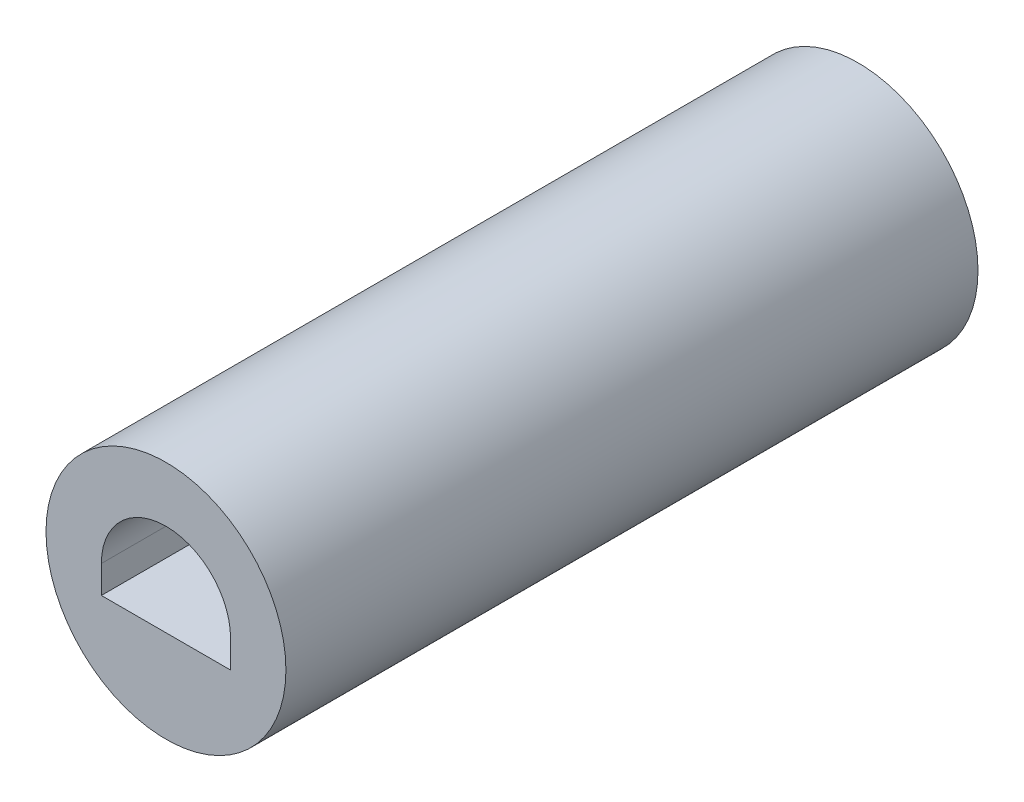
ISO-10303-21;
HEADER;
FILE_DESCRIPTION(('STEP AP214'),'2;1');
FILE_NAME('part.step','',(''),(''),'','','');
FILE_SCHEMA(('AUTOMOTIVE_DESIGN { 1 0 10303 214 1 1 1 1 }'));
ENDSEC;
DATA;
#1=APPLICATION_CONTEXT('core data for automotive mechanical design processes');
#2=APPLICATION_PROTOCOL_DEFINITION('international standard','automotive_design',2000,#1);
#3=PRODUCT_CONTEXT('',#1,'mechanical');
#4=PRODUCT('Part','Part','',(#3));
#5=PRODUCT_RELATED_PRODUCT_CATEGORY('part','',(#4));
#6=PRODUCT_DEFINITION_FORMATION('','',#4);
#7=PRODUCT_DEFINITION_CONTEXT('part definition',#1,'design');
#8=PRODUCT_DEFINITION('design','',#6,#7);
#9=PRODUCT_DEFINITION_SHAPE('','',#8);
#10=(LENGTH_UNIT() NAMED_UNIT(*) SI_UNIT(.MILLI.,.METRE.));
#11=(NAMED_UNIT(*) PLANE_ANGLE_UNIT() SI_UNIT($,.RADIAN.));
#12=(NAMED_UNIT(*) SI_UNIT($,.STERADIAN.) SOLID_ANGLE_UNIT());
#13=UNCERTAINTY_MEASURE_WITH_UNIT(LENGTH_MEASURE(1.E-05),#10,'distance_accuracy_value','');
#14=(GEOMETRIC_REPRESENTATION_CONTEXT(3) GLOBAL_UNCERTAINTY_ASSIGNED_CONTEXT((#13)) GLOBAL_UNIT_ASSIGNED_CONTEXT((#10,
#11,#12)) REPRESENTATION_CONTEXT('',''));
#15=CARTESIAN_POINT('',(0.,0.,0.));
#16=DIRECTION('',(0.,0.,1.));
#17=DIRECTION('',(1.,0.,0.));
#18=AXIS2_PLACEMENT_3D('',#15,#16,#17);
#19=CARTESIAN_POINT('',(0.,0.,9.525));
#20=DIRECTION('',(0.,0.,-1.));
#21=DIRECTION('',(-1.,0.,0.));
#22=AXIS2_PLACEMENT_3D('',#19,#20,#21);
#23=CYLINDRICAL_SURFACE('',#22,1.651);
#24=CARTESIAN_POINT('',(0.,0.,9.525));
#25=DIRECTION('',(0.,0.,1.));
#26=DIRECTION('',(1.,0.,0.));
#27=AXIS2_PLACEMENT_3D('',#24,#25,#26);
#28=CIRCLE('',#27,1.651);
#29=CARTESIAN_POINT('',(1.651,0.,9.525));
#30=VERTEX_POINT('',#29);
#31=EDGE_CURVE('E11',#30,#30,#28,.T.);
#32=ORIENTED_EDGE('',*,*,#31,.F.);
#33=EDGE_LOOP('',(#32));
#34=FACE_BOUND('',#33,.T.);
#35=CARTESIAN_POINT('',(0.,0.,0.));
#36=DIRECTION('',(0.,0.,1.));
#37=DIRECTION('',(1.,0.,0.));
#38=AXIS2_PLACEMENT_3D('',#35,#36,#37);
#39=CIRCLE('',#38,1.651);
#40=CARTESIAN_POINT('',(1.651,0.,0.));
#41=VERTEX_POINT('',#40);
#42=EDGE_CURVE('E38',#41,#41,#39,.T.);
#43=ORIENTED_EDGE('',*,*,#42,.T.);
#44=EDGE_LOOP('',(#43));
#45=FACE_BOUND('',#44,.T.);
#46=ADVANCED_FACE('F35',(#34,#45),#23,.T.);
#47=CARTESIAN_POINT('',(0.,0.,9.525));
#48=DIRECTION('',(0.,0.,1.));
#49=DIRECTION('',(1.,0.,0.));
#50=AXIS2_PLACEMENT_3D('',#47,#48,#49);
#51=PLANE('',#50);
#52=CARTESIAN_POINT('',(0.,0.,9.525));
#53=DIRECTION('',(0.,0.,1.));
#54=DIRECTION('',(1.,0.,0.));
#55=AXIS2_PLACEMENT_3D('',#52,#53,#54);
#56=CIRCLE('',#55,0.889);
#57=CARTESIAN_POINT('',(0.889,0.,9.525));
#58=VERTEX_POINT('',#57);
#59=CARTESIAN_POINT('',(-0.889,0.,9.525));
#60=VERTEX_POINT('',#59);
#61=EDGE_CURVE('E49',#58,#60,#56,.T.);
#62=ORIENTED_EDGE('',*,*,#61,.F.);
#63=DIRECTION('',(0.,1.,0.));
#64=VECTOR('',#63,1.);
#65=CARTESIAN_POINT('',(0.889,0.,9.525));
#66=LINE('',#65,#64);
#67=CARTESIAN_POINT('',(0.889,-0.381,9.525));
#68=VERTEX_POINT('',#67);
#69=EDGE_CURVE('E100',#68,#58,#66,.T.);
#70=ORIENTED_EDGE('',*,*,#69,.F.);
#71=DIRECTION('',(1.,0.,0.));
#72=VECTOR('',#71,1.);
#73=CARTESIAN_POINT('',(0.889,-0.381,9.525));
#74=LINE('',#73,#72);
#75=CARTESIAN_POINT('',(-0.889,-0.381,9.525));
#76=VERTEX_POINT('',#75);
#77=EDGE_CURVE('E106',#76,#68,#74,.T.);
#78=ORIENTED_EDGE('',*,*,#77,.F.);
#79=DIRECTION('',(0.,-1.,0.));
#80=VECTOR('',#79,1.);
#81=CARTESIAN_POINT('',(-0.889,0.,9.525));
#82=LINE('',#81,#80);
#83=EDGE_CURVE('E84',#60,#76,#82,.T.);
#84=ORIENTED_EDGE('',*,*,#83,.F.);
#85=EDGE_LOOP('',(#62,#70,#78,#84));
#86=FACE_BOUND('',#85,.T.);
#87=ORIENTED_EDGE('',*,*,#31,.T.);
#88=EDGE_LOOP('',(#87));
#89=FACE_BOUND('',#88,.T.);
#90=ADVANCED_FACE('F112',(#86,#89),#51,.T.);
#91=CARTESIAN_POINT('',(0.,0.,0.));
#92=DIRECTION('',(0.,0.,1.));
#93=DIRECTION('',(1.,0.,0.));
#94=AXIS2_PLACEMENT_3D('',#91,#92,#93);
#95=PLANE('',#94);
#96=ORIENTED_EDGE('',*,*,#42,.F.);
#97=EDGE_LOOP('',(#96));
#98=FACE_BOUND('',#97,.T.);
#99=ADVANCED_FACE('F124',(#98),#95,.F.);
#100=CARTESIAN_POINT('',(0.,0.,6.985));
#101=DIRECTION('',(0.,0.,1.));
#102=DIRECTION('',(1.,0.,0.));
#103=AXIS2_PLACEMENT_3D('',#100,#101,#102);
#104=CYLINDRICAL_SURFACE('',#103,0.889);
#105=ORIENTED_EDGE('',*,*,#61,.T.);
#106=DIRECTION('',(0.,0.,1.));
#107=VECTOR('',#106,1.);
#108=CARTESIAN_POINT('',(-0.889,0.,6.985));
#109=LINE('',#108,#107);
#110=CARTESIAN_POINT('',(-0.889,0.,6.985));
#111=VERTEX_POINT('',#110);
#112=EDGE_CURVE('E72',#111,#60,#109,.T.);
#113=ORIENTED_EDGE('',*,*,#112,.F.);
#114=CARTESIAN_POINT('',(0.,0.,6.985));
#115=DIRECTION('',(0.,0.,1.));
#116=DIRECTION('',(1.,0.,0.));
#117=AXIS2_PLACEMENT_3D('',#114,#115,#116);
#118=CIRCLE('',#117,0.889);
#119=CARTESIAN_POINT('',(0.889,0.,6.985));
#120=VERTEX_POINT('',#119);
#121=EDGE_CURVE('E98',#120,#111,#118,.T.);
#122=ORIENTED_EDGE('',*,*,#121,.F.);
#123=DIRECTION('',(0.,0.,1.));
#124=VECTOR('',#123,1.);
#125=CARTESIAN_POINT('',(0.889,0.,6.985));
#126=LINE('',#125,#124);
#127=EDGE_CURVE('E57',#120,#58,#126,.T.);
#128=ORIENTED_EDGE('',*,*,#127,.T.);
#129=EDGE_LOOP('',(#105,#113,#122,#128));
#130=FACE_BOUND('',#129,.T.);
#131=ADVANCED_FACE('F117',(#130),#104,.F.);
#132=CARTESIAN_POINT('',(0.889,0.,6.985));
#133=DIRECTION('',(1.,0.,0.));
#134=DIRECTION('',(0.,0.,-1.));
#135=AXIS2_PLACEMENT_3D('',#132,#133,#134);
#136=PLANE('',#135);
#137=ORIENTED_EDGE('',*,*,#69,.T.);
#138=ORIENTED_EDGE('',*,*,#127,.F.);
#139=DIRECTION('',(0.,1.,0.));
#140=VECTOR('',#139,1.);
#141=CARTESIAN_POINT('',(0.889,0.,6.985));
#142=LINE('',#141,#140);
#143=CARTESIAN_POINT('',(0.889,-0.381,6.985));
#144=VERTEX_POINT('',#143);
#145=EDGE_CURVE('E95',#144,#120,#142,.T.);
#146=ORIENTED_EDGE('',*,*,#145,.F.);
#147=DIRECTION('',(0.,0.,1.));
#148=VECTOR('',#147,1.);
#149=CARTESIAN_POINT('',(0.889,-0.381,6.985));
#150=LINE('',#149,#148);
#151=EDGE_CURVE('E88',#144,#68,#150,.T.);
#152=ORIENTED_EDGE('',*,*,#151,.T.);
#153=EDGE_LOOP('',(#137,#138,#146,#152));
#154=FACE_BOUND('',#153,.T.);
#155=ADVANCED_FACE('F115',(#154),#136,.F.);
#156=CARTESIAN_POINT('',(0.889,-0.381,6.985));
#157=DIRECTION('',(0.,-1.,0.));
#158=DIRECTION('',(1.,0.,0.));
#159=AXIS2_PLACEMENT_3D('',#156,#157,#158);
#160=PLANE('',#159);
#161=ORIENTED_EDGE('',*,*,#77,.T.);
#162=ORIENTED_EDGE('',*,*,#151,.F.);
#163=DIRECTION('',(1.,0.,0.));
#164=VECTOR('',#163,1.);
#165=CARTESIAN_POINT('',(-0.889,-0.381,6.985));
#166=LINE('',#165,#164);
#167=CARTESIAN_POINT('',(-0.889,-0.381,6.985));
#168=VERTEX_POINT('',#167);
#169=EDGE_CURVE('E91',#168,#144,#166,.T.);
#170=ORIENTED_EDGE('',*,*,#169,.F.);
#171=DIRECTION('',(0.,0.,1.));
#172=VECTOR('',#171,1.);
#173=CARTESIAN_POINT('',(-0.889,-0.381,6.985));
#174=LINE('',#173,#172);
#175=EDGE_CURVE('E77',#168,#76,#174,.T.);
#176=ORIENTED_EDGE('',*,*,#175,.T.);
#177=EDGE_LOOP('',(#161,#162,#170,#176));
#178=FACE_BOUND('',#177,.T.);
#179=ADVANCED_FACE('F92',(#178),#160,.F.);
#180=CARTESIAN_POINT('',(-0.889,0.,6.985));
#181=DIRECTION('',(-1.,0.,0.));
#182=DIRECTION('',(0.,0.,1.));
#183=AXIS2_PLACEMENT_3D('',#180,#181,#182);
#184=PLANE('',#183);
#185=ORIENTED_EDGE('',*,*,#83,.T.);
#186=ORIENTED_EDGE('',*,*,#175,.F.);
#187=DIRECTION('',(0.,-1.,0.));
#188=VECTOR('',#187,1.);
#189=CARTESIAN_POINT('',(-0.889,0.,6.985));
#190=LINE('',#189,#188);
#191=EDGE_CURVE('E81',#111,#168,#190,.T.);
#192=ORIENTED_EDGE('',*,*,#191,.F.);
#193=ORIENTED_EDGE('',*,*,#112,.T.);
#194=EDGE_LOOP('',(#185,#186,#192,#193));
#195=FACE_BOUND('',#194,.T.);
#196=ADVANCED_FACE('F79',(#195),#184,.F.);
#197=CARTESIAN_POINT('',(0.,0.,6.985));
#198=DIRECTION('',(0.,0.,1.));
#199=DIRECTION('',(1.,0.,0.));
#200=AXIS2_PLACEMENT_3D('',#197,#198,#199);
#201=PLANE('',#200);
#202=ORIENTED_EDGE('',*,*,#121,.T.);
#203=ORIENTED_EDGE('',*,*,#191,.T.);
#204=ORIENTED_EDGE('',*,*,#169,.T.);
#205=ORIENTED_EDGE('',*,*,#145,.T.);
#206=EDGE_LOOP('',(#202,#203,#204,#205));
#207=FACE_BOUND('',#206,.T.);
#208=ADVANCED_FACE('F97',(#207),#201,.T.);
#209=CLOSED_SHELL('',(#46,#90,#99,#131,#155,#179,#196,#208));
#210=MANIFOLD_SOLID_BREP('B2',#209);
#211=ADVANCED_BREP_SHAPE_REPRESENTATION('',(#18,#210),#14);
#212=SHAPE_DEFINITION_REPRESENTATION(#9,#211);
ENDSEC;
END-ISO-10303-21;
